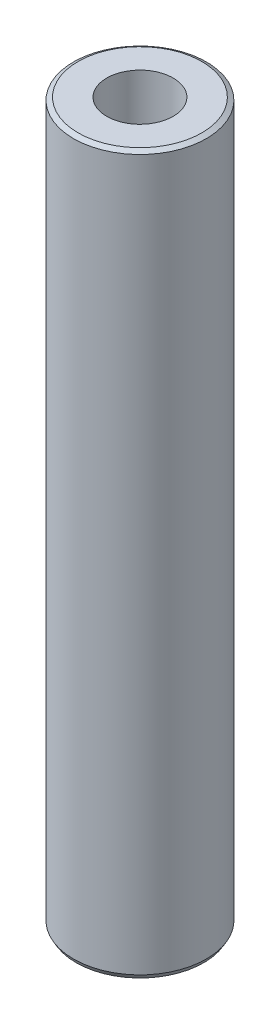
ISO-10303-21;
HEADER;
FILE_DESCRIPTION(('STEP AP214'),'2;1');
FILE_NAME('part.step','',(''),(''),'','','');
FILE_SCHEMA(('AUTOMOTIVE_DESIGN { 1 0 10303 214 1 1 1 1 }'));
ENDSEC;
DATA;
#1=APPLICATION_CONTEXT('core data for automotive mechanical design processes');
#2=APPLICATION_PROTOCOL_DEFINITION('international standard','automotive_design',2000,#1);
#3=PRODUCT_CONTEXT('',#1,'mechanical');
#4=PRODUCT('Part','Part','',(#3));
#5=PRODUCT_RELATED_PRODUCT_CATEGORY('part','',(#4));
#6=PRODUCT_DEFINITION_FORMATION('','',#4);
#7=PRODUCT_DEFINITION_CONTEXT('part definition',#1,'design');
#8=PRODUCT_DEFINITION('design','',#6,#7);
#9=PRODUCT_DEFINITION_SHAPE('','',#8);
#10=(LENGTH_UNIT() NAMED_UNIT(*) SI_UNIT(.MILLI.,.METRE.));
#11=(NAMED_UNIT(*) PLANE_ANGLE_UNIT() SI_UNIT($,.RADIAN.));
#12=(NAMED_UNIT(*) SI_UNIT($,.STERADIAN.) SOLID_ANGLE_UNIT());
#13=UNCERTAINTY_MEASURE_WITH_UNIT(LENGTH_MEASURE(1.E-05),#10,'distance_accuracy_value','');
#14=(GEOMETRIC_REPRESENTATION_CONTEXT(3) GLOBAL_UNCERTAINTY_ASSIGNED_CONTEXT((#13)) GLOBAL_UNIT_ASSIGNED_CONTEXT((#10,
#11,#12)) REPRESENTATION_CONTEXT('',''));
#15=CARTESIAN_POINT('',(0.,0.,0.));
#16=DIRECTION('',(0.,0.,1.));
#17=DIRECTION('',(1.,0.,0.));
#18=AXIS2_PLACEMENT_3D('',#15,#16,#17);
#19=CARTESIAN_POINT('',(0.,27.,0.));
#20=DIRECTION('',(0.,-1.,0.));
#21=DIRECTION('',(0.,0.,-1.));
#22=AXIS2_PLACEMENT_3D('',#19,#20,#21);
#23=CYLINDRICAL_SURFACE('',#22,2.5);
#24=CARTESIAN_POINT('',(0.,0.17320508075688,0.));
#25=DIRECTION('',(0.,1.,0.));
#26=DIRECTION('',(0.,0.,1.));
#27=AXIS2_PLACEMENT_3D('',#24,#25,#26);
#28=CIRCLE('',#27,2.5);
#29=CARTESIAN_POINT('',(0.,0.17320508075688,2.5));
#30=VERTEX_POINT('',#29);
#31=EDGE_CURVE('E48',#30,#30,#28,.T.);
#32=ORIENTED_EDGE('',*,*,#31,.T.);
#33=EDGE_LOOP('',(#32));
#34=FACE_BOUND('',#33,.T.);
#35=CARTESIAN_POINT('',(0.,26.9,0.));
#36=DIRECTION('',(0.,1.,0.));
#37=DIRECTION('',(0.,0.,1.));
#38=AXIS2_PLACEMENT_3D('',#35,#36,#37);
#39=CIRCLE('',#38,2.5);
#40=CARTESIAN_POINT('',(0.,26.9,2.5));
#41=VERTEX_POINT('',#40);
#42=EDGE_CURVE('E52',#41,#41,#39,.F.);
#43=ORIENTED_EDGE('',*,*,#42,.T.);
#44=EDGE_LOOP('',(#43));
#45=FACE_BOUND('',#44,.T.);
#46=ADVANCED_FACE('F36',(#34,#45),#23,.T.);
#47=CARTESIAN_POINT('',(0.,27.,0.));
#48=DIRECTION('',(0.,1.,0.));
#49=DIRECTION('',(0.,0.,1.));
#50=AXIS2_PLACEMENT_3D('',#47,#48,#49);
#51=PLANE('',#50);
#52=CARTESIAN_POINT('',(0.,27.,0.));
#53=DIRECTION('',(0.,1.,0.));
#54=DIRECTION('',(0.,0.,1.));
#55=AXIS2_PLACEMENT_3D('',#52,#53,#54);
#56=CIRCLE('',#55,1.24999999999999);
#57=CARTESIAN_POINT('',(0.,27.,1.24999999999999));
#58=VERTEX_POINT('',#57);
#59=EDGE_CURVE('E60',#58,#58,#56,.T.);
#60=ORIENTED_EDGE('',*,*,#59,.F.);
#61=EDGE_LOOP('',(#60));
#62=FACE_BOUND('',#61,.T.);
#63=CARTESIAN_POINT('',(0.,27.,0.));
#64=DIRECTION('',(0.,1.,0.));
#65=DIRECTION('',(0.,0.,1.));
#66=AXIS2_PLACEMENT_3D('',#63,#64,#65);
#67=CIRCLE('',#66,2.32679491924312);
#68=CARTESIAN_POINT('',(0.,27.,2.32679491924312));
#69=VERTEX_POINT('',#68);
#70=EDGE_CURVE('E10',#69,#69,#67,.T.);
#71=ORIENTED_EDGE('',*,*,#70,.T.);
#72=EDGE_LOOP('',(#71));
#73=FACE_BOUND('',#72,.T.);
#74=ADVANCED_FACE('F66',(#62,#73),#51,.T.);
#75=CARTESIAN_POINT('',(0.,0.,0.));
#76=DIRECTION('',(0.,1.,0.));
#77=DIRECTION('',(0.,0.,1.));
#78=AXIS2_PLACEMENT_3D('',#75,#76,#77);
#79=PLANE('',#78);
#80=CARTESIAN_POINT('',(0.,0.,0.));
#81=DIRECTION('',(0.,1.,0.));
#82=DIRECTION('',(0.,0.,1.));
#83=AXIS2_PLACEMENT_3D('',#80,#81,#82);
#84=CIRCLE('',#83,1.24999999999999);
#85=CARTESIAN_POINT('',(0.,0.,1.24999999999999));
#86=VERTEX_POINT('',#85);
#87=EDGE_CURVE('E57',#86,#86,#84,.T.);
#88=ORIENTED_EDGE('',*,*,#87,.T.);
#89=EDGE_LOOP('',(#88));
#90=FACE_BOUND('',#89,.T.);
#91=CARTESIAN_POINT('',(0.,0.,0.));
#92=DIRECTION('',(0.,1.,0.));
#93=DIRECTION('',(0.,0.,1.));
#94=AXIS2_PLACEMENT_3D('',#91,#92,#93);
#95=CIRCLE('',#94,2.4);
#96=CARTESIAN_POINT('',(0.,0.,2.4));
#97=VERTEX_POINT('',#96);
#98=EDGE_CURVE('E44',#97,#97,#95,.F.);
#99=ORIENTED_EDGE('',*,*,#98,.T.);
#100=EDGE_LOOP('',(#99));
#101=FACE_BOUND('',#100,.T.);
#102=ADVANCED_FACE('F68',(#90,#101),#79,.F.);
#103=CARTESIAN_POINT('',(0.,0.17320508075688,0.));
#104=DIRECTION('',(0.,1.,0.));
#105=DIRECTION('',(0.,0.,1.));
#106=AXIS2_PLACEMENT_3D('',#103,#104,#105);
#107=CONICAL_SURFACE('',#106,2.5,0.523598775598298);
#108=ORIENTED_EDGE('',*,*,#98,.F.);
#109=EDGE_LOOP('',(#108));
#110=FACE_BOUND('',#109,.T.);
#111=ORIENTED_EDGE('',*,*,#31,.F.);
#112=EDGE_LOOP('',(#111));
#113=FACE_BOUND('',#112,.T.);
#114=ADVANCED_FACE('F74',(#110,#113),#107,.T.);
#115=CARTESIAN_POINT('',(0.,27.,0.));
#116=DIRECTION('',(0.,-1.,0.));
#117=DIRECTION('',(0.,0.,-1.));
#118=AXIS2_PLACEMENT_3D('',#115,#116,#117);
#119=CONICAL_SURFACE('',#118,2.32679491924312,1.04719755119659);
#120=ORIENTED_EDGE('',*,*,#42,.F.);
#121=EDGE_LOOP('',(#120));
#122=FACE_BOUND('',#121,.T.);
#123=ORIENTED_EDGE('',*,*,#70,.F.);
#124=EDGE_LOOP('',(#123));
#125=FACE_BOUND('',#124,.T.);
#126=ADVANCED_FACE('F39',(#122,#125),#119,.T.);
#127=CARTESIAN_POINT('',(0.,27.,0.));
#128=DIRECTION('',(0.,1.,0.));
#129=DIRECTION('',(0.,0.,1.));
#130=AXIS2_PLACEMENT_3D('',#127,#128,#129);
#131=CYLINDRICAL_SURFACE('',#130,1.24999999999999);
#132=ORIENTED_EDGE('',*,*,#87,.F.);
#133=EDGE_LOOP('',(#132));
#134=FACE_BOUND('',#133,.T.);
#135=ORIENTED_EDGE('',*,*,#59,.T.);
#136=EDGE_LOOP('',(#135));
#137=FACE_BOUND('',#136,.T.);
#138=ADVANCED_FACE('F64',(#134,#137),#131,.F.);
#139=CLOSED_SHELL('',(#46,#74,#102,#114,#126,#138));
#140=MANIFOLD_SOLID_BREP('B2',#139);
#141=ADVANCED_BREP_SHAPE_REPRESENTATION('',(#18,#140),#14);
#142=SHAPE_DEFINITION_REPRESENTATION(#9,#141);
ENDSEC;
END-ISO-10303-21;
